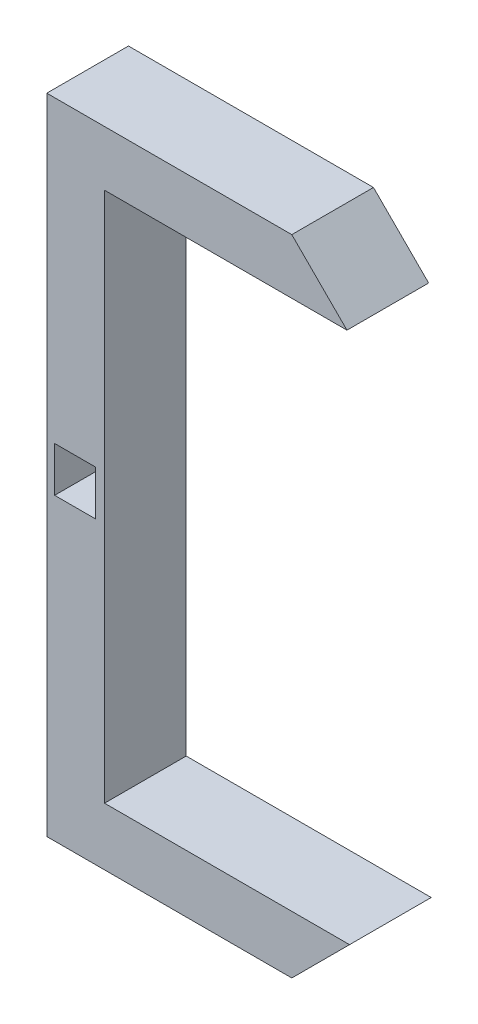
ISO-10303-21;
HEADER;
FILE_DESCRIPTION(('STEP AP214'),'2;1');
FILE_NAME('part.step','',(''),(''),'','','');
FILE_SCHEMA(('AUTOMOTIVE_DESIGN { 1 0 10303 214 1 1 1 1 }'));
ENDSEC;
DATA;
#1=APPLICATION_CONTEXT('core data for automotive mechanical design processes');
#2=APPLICATION_PROTOCOL_DEFINITION('international standard','automotive_design',2000,#1);
#3=PRODUCT_CONTEXT('',#1,'mechanical');
#4=PRODUCT('Part','Part','',(#3));
#5=PRODUCT_RELATED_PRODUCT_CATEGORY('part','',(#4));
#6=PRODUCT_DEFINITION_FORMATION('','',#4);
#7=PRODUCT_DEFINITION_CONTEXT('part definition',#1,'design');
#8=PRODUCT_DEFINITION('design','',#6,#7);
#9=PRODUCT_DEFINITION_SHAPE('','',#8);
#10=(LENGTH_UNIT() NAMED_UNIT(*) SI_UNIT(.MILLI.,.METRE.));
#11=(NAMED_UNIT(*) PLANE_ANGLE_UNIT() SI_UNIT($,.RADIAN.));
#12=(NAMED_UNIT(*) SI_UNIT($,.STERADIAN.) SOLID_ANGLE_UNIT());
#13=UNCERTAINTY_MEASURE_WITH_UNIT(LENGTH_MEASURE(1.E-05),#10,'distance_accuracy_value','');
#14=(GEOMETRIC_REPRESENTATION_CONTEXT(3) GLOBAL_UNCERTAINTY_ASSIGNED_CONTEXT((#13)) GLOBAL_UNIT_ASSIGNED_CONTEXT((#10,
#11,#12)) REPRESENTATION_CONTEXT('',''));
#15=CARTESIAN_POINT('',(0.,0.,0.));
#16=DIRECTION('',(0.,0.,1.));
#17=DIRECTION('',(1.,0.,0.));
#18=AXIS2_PLACEMENT_3D('',#15,#16,#17);
#19=CARTESIAN_POINT('',(0.,0.,10.));
#20=DIRECTION('',(0.,0.,1.));
#21=DIRECTION('',(1.,0.,0.));
#22=AXIS2_PLACEMENT_3D('',#19,#20,#21);
#23=PLANE('',#22);
#24=DIRECTION('',(-0.707106781186552,0.707106781186543,0.));
#25=VECTOR('',#24,1.);
#26=CARTESIAN_POINT('',(-15.0051942402797,49.714572153724,10.));
#27=LINE('',#26,#25);
#28=CARTESIAN_POINT('',(-15.0051942402797,49.714572153724,10.));
#29=VERTEX_POINT('',#28);
#30=CARTESIAN_POINT('',(-21.7606734895522,56.4700514029965,10.));
#31=VERTEX_POINT('',#30);
#32=EDGE_CURVE('E163',#29,#31,#27,.T.);
#33=ORIENTED_EDGE('',*,*,#32,.T.);
#34=DIRECTION('',(-1.,0.,0.));
#35=VECTOR('',#34,1.);
#36=CARTESIAN_POINT('',(-51.7606734895523,56.4700514029965,10.));
#37=LINE('',#36,#35);
#38=CARTESIAN_POINT('',(-51.7606734895523,56.4700514029965,10.));
#39=VERTEX_POINT('',#38);
#40=EDGE_CURVE('E167',#31,#39,#37,.T.);
#41=ORIENTED_EDGE('',*,*,#40,.T.);
#42=DIRECTION('',(0.,-1.,0.));
#43=VECTOR('',#42,1.);
#44=CARTESIAN_POINT('',(-51.7606734895523,56.4700514029965,10.));
#45=LINE('',#44,#43);
#46=CARTESIAN_POINT('',(-51.7606734895523,-22.3564956581415,10.));
#47=VERTEX_POINT('',#46);
#48=EDGE_CURVE('E171',#39,#47,#45,.T.);
#49=ORIENTED_EDGE('',*,*,#48,.T.);
#50=DIRECTION('',(1.,0.,0.));
#51=VECTOR('',#50,1.);
#52=CARTESIAN_POINT('',(-21.7606734895522,-22.3564956581415,10.));
#53=LINE('',#52,#51);
#54=CARTESIAN_POINT('',(-21.7606734895522,-22.3564956581415,10.));
#55=VERTEX_POINT('',#54);
#56=EDGE_CURVE('E174',#47,#55,#53,.T.);
#57=ORIENTED_EDGE('',*,*,#56,.T.);
#58=DIRECTION('',(0.707106781186543,0.707106781186552,0.));
#59=VECTOR('',#58,1.);
#60=CARTESIAN_POINT('',(-14.6896056776868,-15.285427846276,10.));
#61=LINE('',#60,#59);
#62=CARTESIAN_POINT('',(-14.6896056776868,-15.285427846276,10.));
#63=VERTEX_POINT('',#62);
#64=EDGE_CURVE('E177',#55,#63,#61,.T.);
#65=ORIENTED_EDGE('',*,*,#64,.T.);
#66=DIRECTION('',(-1.,0.,0.));
#67=VECTOR('',#66,1.);
#68=CARTESIAN_POINT('',(-44.6896056776868,-15.285427846276,10.));
#69=LINE('',#68,#67);
#70=CARTESIAN_POINT('',(-44.6896056776868,-15.285427846276,10.));
#71=VERTEX_POINT('',#70);
#72=EDGE_CURVE('E180',#63,#71,#69,.T.);
#73=ORIENTED_EDGE('',*,*,#72,.T.);
#74=DIRECTION('',(0.,1.,0.));
#75=VECTOR('',#74,1.);
#76=CARTESIAN_POINT('',(-44.6896056776868,49.714572153724,10.));
#77=LINE('',#76,#75);
#78=CARTESIAN_POINT('',(-44.6896056776868,49.714572153724,10.));
#79=VERTEX_POINT('',#78);
#80=EDGE_CURVE('E183',#71,#79,#77,.T.);
#81=ORIENTED_EDGE('',*,*,#80,.T.);
#82=DIRECTION('',(1.,0.,0.));
#83=VECTOR('',#82,1.);
#84=CARTESIAN_POINT('',(-15.0051942402797,49.714572153724,10.));
#85=LINE('',#84,#83);
#86=EDGE_CURVE('E186',#79,#29,#85,.T.);
#87=ORIENTED_EDGE('',*,*,#86,.T.);
#88=EDGE_LOOP('',(#33,#41,#49,#57,#65,#73,#81,#87));
#89=FACE_BOUND('',#88,.T.);
#90=DIRECTION('',(-1.,0.,0.));
#91=VECTOR('',#90,1.);
#92=CARTESIAN_POINT('',(-50.7987108134275,19.8067778724275,10.));
#93=LINE('',#92,#91);
#94=CARTESIAN_POINT('',(-45.7987108134275,19.8067778724275,10.));
#95=VERTEX_POINT('',#94);
#96=CARTESIAN_POINT('',(-50.7987108134275,19.8067778724275,10.));
#97=VERTEX_POINT('',#96);
#98=EDGE_CURVE('E136',#95,#97,#93,.T.);
#99=ORIENTED_EDGE('',*,*,#98,.F.);
#100=DIRECTION('',(0.,1.,0.));
#101=VECTOR('',#100,1.);
#102=CARTESIAN_POINT('',(-45.7987108134275,19.8067778724275,10.));
#103=LINE('',#102,#101);
#104=CARTESIAN_POINT('',(-45.7987108134275,14.3067778724275,10.));
#105=VERTEX_POINT('',#104);
#106=EDGE_CURVE('E127',#105,#95,#103,.T.);
#107=ORIENTED_EDGE('',*,*,#106,.F.);
#108=DIRECTION('',(1.,0.,0.));
#109=VECTOR('',#108,1.);
#110=CARTESIAN_POINT('',(-50.7987108134275,14.3067778724275,10.));
#111=LINE('',#110,#109);
#112=CARTESIAN_POINT('',(-50.7987108134275,14.3067778724275,10.));
#113=VERTEX_POINT('',#112);
#114=EDGE_CURVE('E152',#113,#105,#111,.T.);
#115=ORIENTED_EDGE('',*,*,#114,.F.);
#116=DIRECTION('',(0.,-1.,0.));
#117=VECTOR('',#116,1.);
#118=CARTESIAN_POINT('',(-50.7987108134275,19.8067778724275,10.));
#119=LINE('',#118,#117);
#120=EDGE_CURVE('E148',#97,#113,#119,.T.);
#121=ORIENTED_EDGE('',*,*,#120,.F.);
#122=EDGE_LOOP('',(#99,#107,#115,#121));
#123=FACE_BOUND('',#122,.T.);
#124=ADVANCED_FACE('F39',(#89,#123),#23,.T.);
#125=CARTESIAN_POINT('',(0.,0.,0.));
#126=DIRECTION('',(0.,0.,1.));
#127=DIRECTION('',(1.,0.,0.));
#128=AXIS2_PLACEMENT_3D('',#125,#126,#127);
#129=PLANE('',#128);
#130=DIRECTION('',(-0.707106781186552,0.707106781186543,0.));
#131=VECTOR('',#130,1.);
#132=CARTESIAN_POINT('',(-15.0051942402797,49.714572153724,0.));
#133=LINE('',#132,#131);
#134=CARTESIAN_POINT('',(-15.0051942402797,49.714572153724,0.));
#135=VERTEX_POINT('',#134);
#136=CARTESIAN_POINT('',(-21.7606734895522,56.4700514029965,0.));
#137=VERTEX_POINT('',#136);
#138=EDGE_CURVE('E144',#135,#137,#133,.T.);
#139=ORIENTED_EDGE('',*,*,#138,.F.);
#140=DIRECTION('',(1.,0.,0.));
#141=VECTOR('',#140,1.);
#142=CARTESIAN_POINT('',(-15.0051942402797,49.714572153724,0.));
#143=LINE('',#142,#141);
#144=CARTESIAN_POINT('',(-44.6896056776868,49.714572153724,0.));
#145=VERTEX_POINT('',#144);
#146=EDGE_CURVE('E168',#145,#135,#143,.T.);
#147=ORIENTED_EDGE('',*,*,#146,.F.);
#148=DIRECTION('',(0.,1.,0.));
#149=VECTOR('',#148,1.);
#150=CARTESIAN_POINT('',(-44.6896056776868,49.714572153724,0.));
#151=LINE('',#150,#149);
#152=CARTESIAN_POINT('',(-44.6896056776868,-15.285427846276,0.));
#153=VERTEX_POINT('',#152);
#154=EDGE_CURVE('E209',#153,#145,#151,.T.);
#155=ORIENTED_EDGE('',*,*,#154,.F.);
#156=DIRECTION('',(-1.,0.,0.));
#157=VECTOR('',#156,1.);
#158=CARTESIAN_POINT('',(-44.6896056776868,-15.285427846276,0.));
#159=LINE('',#158,#157);
#160=CARTESIAN_POINT('',(-14.6896056776868,-15.285427846276,0.));
#161=VERTEX_POINT('',#160);
#162=EDGE_CURVE('E206',#161,#153,#159,.T.);
#163=ORIENTED_EDGE('',*,*,#162,.F.);
#164=DIRECTION('',(0.707106781186543,0.707106781186552,0.));
#165=VECTOR('',#164,1.);
#166=CARTESIAN_POINT('',(-14.6896056776868,-15.285427846276,0.));
#167=LINE('',#166,#165);
#168=CARTESIAN_POINT('',(-21.7606734895522,-22.3564956581415,0.));
#169=VERTEX_POINT('',#168);
#170=EDGE_CURVE('E203',#169,#161,#167,.T.);
#171=ORIENTED_EDGE('',*,*,#170,.F.);
#172=DIRECTION('',(1.,0.,0.));
#173=VECTOR('',#172,1.);
#174=CARTESIAN_POINT('',(-21.7606734895522,-22.3564956581415,0.));
#175=LINE('',#174,#173);
#176=CARTESIAN_POINT('',(-51.7606734895523,-22.3564956581415,0.));
#177=VERTEX_POINT('',#176);
#178=EDGE_CURVE('E200',#177,#169,#175,.T.);
#179=ORIENTED_EDGE('',*,*,#178,.F.);
#180=DIRECTION('',(0.,-1.,0.));
#181=VECTOR('',#180,1.);
#182=CARTESIAN_POINT('',(-51.7606734895523,-22.3564956581415,0.));
#183=LINE('',#182,#181);
#184=CARTESIAN_POINT('',(-51.7606734895523,56.4700514029965,0.));
#185=VERTEX_POINT('',#184);
#186=EDGE_CURVE('E197',#185,#177,#183,.T.);
#187=ORIENTED_EDGE('',*,*,#186,.F.);
#188=DIRECTION('',(-1.,0.,0.));
#189=VECTOR('',#188,1.);
#190=CARTESIAN_POINT('',(-51.7606734895523,56.4700514029965,0.));
#191=LINE('',#190,#189);
#192=EDGE_CURVE('E193',#137,#185,#191,.T.);
#193=ORIENTED_EDGE('',*,*,#192,.F.);
#194=EDGE_LOOP('',(#139,#147,#155,#163,#171,#179,#187,#193));
#195=FACE_BOUND('',#194,.T.);
#196=DIRECTION('',(0.,-1.,0.));
#197=VECTOR('',#196,1.);
#198=CARTESIAN_POINT('',(-45.7987108134275,0.,0.));
#199=LINE('',#198,#197);
#200=CARTESIAN_POINT('',(-45.7987108134275,19.8067778724275,0.));
#201=VERTEX_POINT('',#200);
#202=CARTESIAN_POINT('',(-45.7987108134275,14.3067778724275,0.));
#203=VERTEX_POINT('',#202);
#204=EDGE_CURVE('E11',#201,#203,#199,.T.);
#205=ORIENTED_EDGE('',*,*,#204,.F.);
#206=DIRECTION('',(1.,0.,0.));
#207=VECTOR('',#206,1.);
#208=CARTESIAN_POINT('',(0.,19.8067778724275,0.));
#209=LINE('',#208,#207);
#210=CARTESIAN_POINT('',(-50.7987108134275,19.8067778724275,0.));
#211=VERTEX_POINT('',#210);
#212=EDGE_CURVE('E48',#211,#201,#209,.T.);
#213=ORIENTED_EDGE('',*,*,#212,.F.);
#214=DIRECTION('',(0.,1.,0.));
#215=VECTOR('',#214,1.);
#216=CARTESIAN_POINT('',(-50.7987108134275,0.,0.));
#217=LINE('',#216,#215);
#218=CARTESIAN_POINT('',(-50.7987108134275,14.3067778724275,0.));
#219=VERTEX_POINT('',#218);
#220=EDGE_CURVE('E248',#219,#211,#217,.T.);
#221=ORIENTED_EDGE('',*,*,#220,.F.);
#222=DIRECTION('',(-1.,0.,0.));
#223=VECTOR('',#222,1.);
#224=CARTESIAN_POINT('',(0.,14.3067778724275,0.));
#225=LINE('',#224,#223);
#226=EDGE_CURVE('E245',#203,#219,#225,.T.);
#227=ORIENTED_EDGE('',*,*,#226,.F.);
#228=EDGE_LOOP('',(#205,#213,#221,#227));
#229=FACE_BOUND('',#228,.T.);
#230=ADVANCED_FACE('F256',(#195,#229),#129,.F.);
#231=CARTESIAN_POINT('',(-15.0051942402797,49.714572153724,10.));
#232=DIRECTION('',(-0.707106781186543,-0.707106781186552,0.));
#233=DIRECTION('',(0.707106781186552,-0.707106781186543,0.));
#234=AXIS2_PLACEMENT_3D('',#231,#232,#233);
#235=PLANE('',#234);
#236=ORIENTED_EDGE('',*,*,#138,.T.);
#237=DIRECTION('',(0.,0.,-1.));
#238=VECTOR('',#237,1.);
#239=CARTESIAN_POINT('',(-21.7606734895522,56.4700514029965,10.));
#240=LINE('',#239,#238);
#241=EDGE_CURVE('E241',#31,#137,#240,.T.);
#242=ORIENTED_EDGE('',*,*,#241,.F.);
#243=ORIENTED_EDGE('',*,*,#32,.F.);
#244=DIRECTION('',(0.,0.,-1.));
#245=VECTOR('',#244,1.);
#246=CARTESIAN_POINT('',(-15.0051942402797,49.714572153724,10.));
#247=LINE('',#246,#245);
#248=EDGE_CURVE('E189',#29,#135,#247,.T.);
#249=ORIENTED_EDGE('',*,*,#248,.T.);
#250=EDGE_LOOP('',(#236,#242,#243,#249));
#251=FACE_BOUND('',#250,.T.);
#252=ADVANCED_FACE('F41',(#251),#235,.F.);
#253=CARTESIAN_POINT('',(-51.7606734895523,56.4700514029965,10.));
#254=DIRECTION('',(0.,-1.,0.));
#255=DIRECTION('',(1.,0.,0.));
#256=AXIS2_PLACEMENT_3D('',#253,#254,#255);
#257=PLANE('',#256);
#258=ORIENTED_EDGE('',*,*,#192,.T.);
#259=DIRECTION('',(0.,0.,-1.));
#260=VECTOR('',#259,1.);
#261=CARTESIAN_POINT('',(-51.7606734895523,56.4700514029965,10.));
#262=LINE('',#261,#260);
#263=EDGE_CURVE('E237',#39,#185,#262,.T.);
#264=ORIENTED_EDGE('',*,*,#263,.F.);
#265=ORIENTED_EDGE('',*,*,#40,.F.);
#266=ORIENTED_EDGE('',*,*,#241,.T.);
#267=EDGE_LOOP('',(#258,#264,#265,#266));
#268=FACE_BOUND('',#267,.T.);
#269=ADVANCED_FACE('F297',(#268),#257,.F.);
#270=CARTESIAN_POINT('',(-51.7606734895523,-22.3564956581415,10.));
#271=DIRECTION('',(1.,0.,0.));
#272=DIRECTION('',(0.,0.,-1.));
#273=AXIS2_PLACEMENT_3D('',#270,#271,#272);
#274=PLANE('',#273);
#275=ORIENTED_EDGE('',*,*,#186,.T.);
#276=DIRECTION('',(0.,0.,-1.));
#277=VECTOR('',#276,1.);
#278=CARTESIAN_POINT('',(-51.7606734895523,-22.3564956581415,10.));
#279=LINE('',#278,#277);
#280=EDGE_CURVE('E233',#47,#177,#279,.T.);
#281=ORIENTED_EDGE('',*,*,#280,.F.);
#282=ORIENTED_EDGE('',*,*,#48,.F.);
#283=ORIENTED_EDGE('',*,*,#263,.T.);
#284=EDGE_LOOP('',(#275,#281,#282,#283));
#285=FACE_BOUND('',#284,.T.);
#286=ADVANCED_FACE('F294',(#285),#274,.F.);
#287=CARTESIAN_POINT('',(-21.7606734895522,-22.3564956581415,10.));
#288=DIRECTION('',(0.,1.,0.));
#289=DIRECTION('',(0.,0.,1.));
#290=AXIS2_PLACEMENT_3D('',#287,#288,#289);
#291=PLANE('',#290);
#292=ORIENTED_EDGE('',*,*,#178,.T.);
#293=DIRECTION('',(0.,0.,-1.));
#294=VECTOR('',#293,1.);
#295=CARTESIAN_POINT('',(-21.7606734895522,-22.3564956581415,10.));
#296=LINE('',#295,#294);
#297=EDGE_CURVE('E229',#55,#169,#296,.T.);
#298=ORIENTED_EDGE('',*,*,#297,.F.);
#299=ORIENTED_EDGE('',*,*,#56,.F.);
#300=ORIENTED_EDGE('',*,*,#280,.T.);
#301=EDGE_LOOP('',(#292,#298,#299,#300));
#302=FACE_BOUND('',#301,.T.);
#303=ADVANCED_FACE('F290',(#302),#291,.F.);
#304=CARTESIAN_POINT('',(-14.6896056776868,-15.285427846276,10.));
#305=DIRECTION('',(-0.707106781186552,0.707106781186543,0.));
#306=DIRECTION('',(-0.707106781186543,-0.707106781186552,0.));
#307=AXIS2_PLACEMENT_3D('',#304,#305,#306);
#308=PLANE('',#307);
#309=ORIENTED_EDGE('',*,*,#170,.T.);
#310=DIRECTION('',(0.,0.,-1.));
#311=VECTOR('',#310,1.);
#312=CARTESIAN_POINT('',(-14.6896056776868,-15.285427846276,10.));
#313=LINE('',#312,#311);
#314=EDGE_CURVE('E225',#63,#161,#313,.T.);
#315=ORIENTED_EDGE('',*,*,#314,.F.);
#316=ORIENTED_EDGE('',*,*,#64,.F.);
#317=ORIENTED_EDGE('',*,*,#297,.T.);
#318=EDGE_LOOP('',(#309,#315,#316,#317));
#319=FACE_BOUND('',#318,.T.);
#320=ADVANCED_FACE('F286',(#319),#308,.F.);
#321=CARTESIAN_POINT('',(-44.6896056776868,-15.285427846276,10.));
#322=DIRECTION('',(0.,-1.,0.));
#323=DIRECTION('',(0.,0.,-1.));
#324=AXIS2_PLACEMENT_3D('',#321,#322,#323);
#325=PLANE('',#324);
#326=ORIENTED_EDGE('',*,*,#162,.T.);
#327=DIRECTION('',(0.,0.,-1.));
#328=VECTOR('',#327,1.);
#329=CARTESIAN_POINT('',(-44.6896056776868,-15.285427846276,10.));
#330=LINE('',#329,#328);
#331=EDGE_CURVE('E221',#71,#153,#330,.T.);
#332=ORIENTED_EDGE('',*,*,#331,.F.);
#333=ORIENTED_EDGE('',*,*,#72,.F.);
#334=ORIENTED_EDGE('',*,*,#314,.T.);
#335=EDGE_LOOP('',(#326,#332,#333,#334));
#336=FACE_BOUND('',#335,.T.);
#337=ADVANCED_FACE('F282',(#336),#325,.F.);
#338=CARTESIAN_POINT('',(-44.6896056776868,49.714572153724,10.));
#339=DIRECTION('',(-1.,0.,0.));
#340=DIRECTION('',(0.,-1.,0.));
#341=AXIS2_PLACEMENT_3D('',#338,#339,#340);
#342=PLANE('',#341);
#343=ORIENTED_EDGE('',*,*,#154,.T.);
#344=DIRECTION('',(0.,0.,-1.));
#345=VECTOR('',#344,1.);
#346=CARTESIAN_POINT('',(-44.6896056776868,49.714572153724,10.));
#347=LINE('',#346,#345);
#348=EDGE_CURVE('E217',#79,#145,#347,.T.);
#349=ORIENTED_EDGE('',*,*,#348,.F.);
#350=ORIENTED_EDGE('',*,*,#80,.F.);
#351=ORIENTED_EDGE('',*,*,#331,.T.);
#352=EDGE_LOOP('',(#343,#349,#350,#351));
#353=FACE_BOUND('',#352,.T.);
#354=ADVANCED_FACE('F278',(#353),#342,.F.);
#355=CARTESIAN_POINT('',(-15.0051942402797,49.714572153724,10.));
#356=DIRECTION('',(0.,1.,0.));
#357=DIRECTION('',(-1.,0.,0.));
#358=AXIS2_PLACEMENT_3D('',#355,#356,#357);
#359=PLANE('',#358);
#360=ORIENTED_EDGE('',*,*,#146,.T.);
#361=ORIENTED_EDGE('',*,*,#248,.F.);
#362=ORIENTED_EDGE('',*,*,#86,.F.);
#363=ORIENTED_EDGE('',*,*,#348,.T.);
#364=EDGE_LOOP('',(#360,#361,#362,#363));
#365=FACE_BOUND('',#364,.T.);
#366=ADVANCED_FACE('F275',(#365),#359,.F.);
#367=CARTESIAN_POINT('',(-45.7987108134275,19.8067778724275,10.));
#368=DIRECTION('',(-1.,0.,0.));
#369=DIRECTION('',(0.,0.,1.));
#370=AXIS2_PLACEMENT_3D('',#367,#368,#369);
#371=PLANE('',#370);
#372=ORIENTED_EDGE('',*,*,#204,.T.);
#373=DIRECTION('',(0.,0.,-1.));
#374=VECTOR('',#373,1.);
#375=CARTESIAN_POINT('',(-45.7987108134275,14.3067778724275,10.));
#376=LINE('',#375,#374);
#377=EDGE_CURVE('E60',#105,#203,#376,.T.);
#378=ORIENTED_EDGE('',*,*,#377,.F.);
#379=ORIENTED_EDGE('',*,*,#106,.T.);
#380=DIRECTION('',(0.,0.,-1.));
#381=VECTOR('',#380,1.);
#382=CARTESIAN_POINT('',(-45.7987108134275,19.8067778724275,10.));
#383=LINE('',#382,#381);
#384=EDGE_CURVE('E130',#95,#201,#383,.T.);
#385=ORIENTED_EDGE('',*,*,#384,.T.);
#386=EDGE_LOOP('',(#372,#378,#379,#385));
#387=FACE_BOUND('',#386,.T.);
#388=ADVANCED_FACE('F129',(#387),#371,.T.);
#389=CARTESIAN_POINT('',(-50.7987108134275,19.8067778724275,10.));
#390=DIRECTION('',(0.,-1.,0.));
#391=DIRECTION('',(0.,0.,-1.));
#392=AXIS2_PLACEMENT_3D('',#389,#390,#391);
#393=PLANE('',#392);
#394=ORIENTED_EDGE('',*,*,#212,.T.);
#395=ORIENTED_EDGE('',*,*,#384,.F.);
#396=ORIENTED_EDGE('',*,*,#98,.T.);
#397=DIRECTION('',(0.,0.,-1.));
#398=VECTOR('',#397,1.);
#399=CARTESIAN_POINT('',(-50.7987108134275,19.8067778724275,10.));
#400=LINE('',#399,#398);
#401=EDGE_CURVE('E145',#97,#211,#400,.T.);
#402=ORIENTED_EDGE('',*,*,#401,.T.);
#403=EDGE_LOOP('',(#394,#395,#396,#402));
#404=FACE_BOUND('',#403,.T.);
#405=ADVANCED_FACE('F139',(#404),#393,.T.);
#406=CARTESIAN_POINT('',(-50.7987108134275,19.8067778724275,10.));
#407=DIRECTION('',(1.,0.,0.));
#408=DIRECTION('',(0.,0.,-1.));
#409=AXIS2_PLACEMENT_3D('',#406,#407,#408);
#410=PLANE('',#409);
#411=ORIENTED_EDGE('',*,*,#220,.T.);
#412=ORIENTED_EDGE('',*,*,#401,.F.);
#413=ORIENTED_EDGE('',*,*,#120,.T.);
#414=DIRECTION('',(0.,0.,-1.));
#415=VECTOR('',#414,1.);
#416=CARTESIAN_POINT('',(-50.7987108134275,14.3067778724275,10.));
#417=LINE('',#416,#415);
#418=EDGE_CURVE('E55',#113,#219,#417,.T.);
#419=ORIENTED_EDGE('',*,*,#418,.T.);
#420=EDGE_LOOP('',(#411,#412,#413,#419));
#421=FACE_BOUND('',#420,.T.);
#422=ADVANCED_FACE('F253',(#421),#410,.T.);
#423=CARTESIAN_POINT('',(-50.7987108134275,14.3067778724275,10.));
#424=DIRECTION('',(0.,1.,0.));
#425=DIRECTION('',(0.,0.,1.));
#426=AXIS2_PLACEMENT_3D('',#423,#424,#425);
#427=PLANE('',#426);
#428=ORIENTED_EDGE('',*,*,#226,.T.);
#429=ORIENTED_EDGE('',*,*,#418,.F.);
#430=ORIENTED_EDGE('',*,*,#114,.T.);
#431=ORIENTED_EDGE('',*,*,#377,.T.);
#432=EDGE_LOOP('',(#428,#429,#430,#431));
#433=FACE_BOUND('',#432,.T.);
#434=ADVANCED_FACE('F257',(#433),#427,.T.);
#435=CLOSED_SHELL('',(#124,#230,#252,#269,#286,#303,#320,#337,#354,#366,#388,#405,#422,#434));
#436=MANIFOLD_SOLID_BREP('B2',#435);
#437=ADVANCED_BREP_SHAPE_REPRESENTATION('',(#18,#436),#14);
#438=SHAPE_DEFINITION_REPRESENTATION(#9,#437);
ENDSEC;
END-ISO-10303-21;
